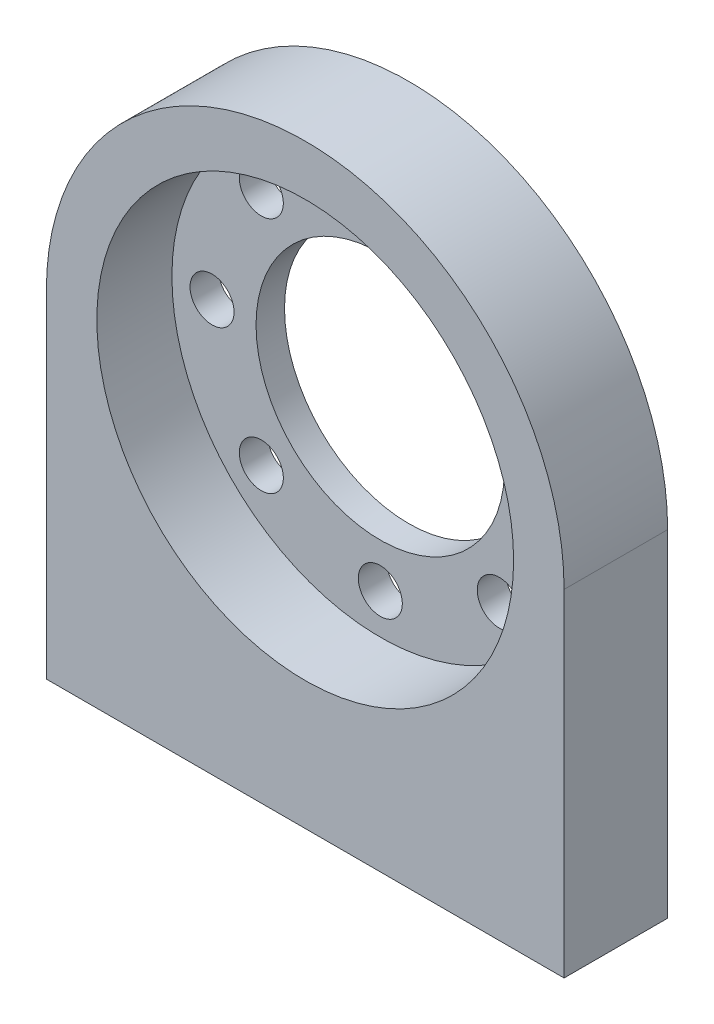
ISO-10303-21;
HEADER;
FILE_DESCRIPTION(('STEP AP214'),'2;1');
FILE_NAME('part.step','',(''),(''),'','','');
FILE_SCHEMA(('AUTOMOTIVE_DESIGN { 1 0 10303 214 1 1 1 1 }'));
ENDSEC;
DATA;
#1=APPLICATION_CONTEXT('core data for automotive mechanical design processes');
#2=APPLICATION_PROTOCOL_DEFINITION('international standard','automotive_design',2000,#1);
#3=PRODUCT_CONTEXT('',#1,'mechanical');
#4=PRODUCT('Part','Part','',(#3));
#5=PRODUCT_RELATED_PRODUCT_CATEGORY('part','',(#4));
#6=PRODUCT_DEFINITION_FORMATION('','',#4);
#7=PRODUCT_DEFINITION_CONTEXT('part definition',#1,'design');
#8=PRODUCT_DEFINITION('design','',#6,#7);
#9=PRODUCT_DEFINITION_SHAPE('','',#8);
#10=(LENGTH_UNIT() NAMED_UNIT(*) SI_UNIT(.MILLI.,.METRE.));
#11=(NAMED_UNIT(*) PLANE_ANGLE_UNIT() SI_UNIT($,.RADIAN.));
#12=(NAMED_UNIT(*) SI_UNIT($,.STERADIAN.) SOLID_ANGLE_UNIT());
#13=UNCERTAINTY_MEASURE_WITH_UNIT(LENGTH_MEASURE(1.E-05),#10,'distance_accuracy_value','');
#14=(GEOMETRIC_REPRESENTATION_CONTEXT(3) GLOBAL_UNCERTAINTY_ASSIGNED_CONTEXT((#13)) GLOBAL_UNIT_ASSIGNED_CONTEXT((#10,
#11,#12)) REPRESENTATION_CONTEXT('',''));
#15=CARTESIAN_POINT('',(0.,0.,0.));
#16=DIRECTION('',(0.,0.,1.));
#17=DIRECTION('',(1.,0.,0.));
#18=AXIS2_PLACEMENT_3D('',#15,#16,#17);
#19=CARTESIAN_POINT('',(0.,0.,8.));
#20=DIRECTION('',(0.,0.,-1.));
#21=DIRECTION('',(-1.,0.,0.));
#22=AXIS2_PLACEMENT_3D('',#19,#20,#21);
#23=PLANE('',#22);
#24=CARTESIAN_POINT('',(0.,0.,8.));
#25=DIRECTION('',(0.,0.,1.));
#26=DIRECTION('',(1.,0.,0.));
#27=AXIS2_PLACEMENT_3D('',#24,#25,#26);
#28=CIRCLE('',#27,16.1);
#29=CARTESIAN_POINT('',(16.1,0.,8.));
#30=VERTEX_POINT('',#29);
#31=EDGE_CURVE('E130',#30,#30,#28,.T.);
#32=ORIENTED_EDGE('',*,*,#31,.F.);
#33=EDGE_LOOP('',(#32));
#34=FACE_BOUND('',#33,.T.);
#35=CARTESIAN_POINT('',(0.,0.,8.));
#36=DIRECTION('',(0.,0.,1.));
#37=DIRECTION('',(-1.,0.,0.));
#38=AXIS2_PLACEMENT_3D('',#35,#36,#37);
#39=CIRCLE('',#38,20.);
#40=CARTESIAN_POINT('',(20.,0.,8.));
#41=VERTEX_POINT('',#40);
#42=CARTESIAN_POINT('',(-20.,0.,8.));
#43=VERTEX_POINT('',#42);
#44=EDGE_CURVE('E97',#41,#43,#39,.T.);
#45=ORIENTED_EDGE('',*,*,#44,.T.);
#46=DIRECTION('',(0.,-1.,0.));
#47=VECTOR('',#46,1.);
#48=CARTESIAN_POINT('',(-20.,0.,8.));
#49=LINE('',#48,#47);
#50=CARTESIAN_POINT('',(-20.,-26.,8.));
#51=VERTEX_POINT('',#50);
#52=EDGE_CURVE('E93',#43,#51,#49,.T.);
#53=ORIENTED_EDGE('',*,*,#52,.T.);
#54=DIRECTION('',(1.,0.,0.));
#55=VECTOR('',#54,1.);
#56=CARTESIAN_POINT('',(-20.,-26.,8.));
#57=LINE('',#56,#55);
#58=CARTESIAN_POINT('',(20.,-26.,8.));
#59=VERTEX_POINT('',#58);
#60=EDGE_CURVE('E95',#51,#59,#57,.T.);
#61=ORIENTED_EDGE('',*,*,#60,.T.);
#62=DIRECTION('',(0.,1.,0.));
#63=VECTOR('',#62,1.);
#64=CARTESIAN_POINT('',(20.,0.,8.));
#65=LINE('',#64,#63);
#66=EDGE_CURVE('E63',#59,#41,#65,.T.);
#67=ORIENTED_EDGE('',*,*,#66,.T.);
#68=EDGE_LOOP('',(#45,#53,#61,#67));
#69=FACE_BOUND('',#68,.T.);
#70=ADVANCED_FACE('F45',(#34,#69),#23,.F.);
#71=CARTESIAN_POINT('',(0.,0.,0.));
#72=DIRECTION('',(0.,0.,-1.));
#73=DIRECTION('',(-1.,0.,0.));
#74=AXIS2_PLACEMENT_3D('',#71,#72,#73);
#75=PLANE('',#74);
#76=CARTESIAN_POINT('',(0.,13.,0.));
#77=DIRECTION('',(0.,0.,-1.));
#78=DIRECTION('',(-1.,0.,0.));
#79=AXIS2_PLACEMENT_3D('',#76,#77,#78);
#80=CIRCLE('',#79,1.7);
#81=CARTESIAN_POINT('',(-1.7,13.,0.));
#82=VERTEX_POINT('',#81);
#83=EDGE_CURVE('E145',#82,#82,#80,.T.);
#84=ORIENTED_EDGE('',*,*,#83,.F.);
#85=EDGE_LOOP('',(#84));
#86=FACE_BOUND('',#85,.T.);
#87=CARTESIAN_POINT('',(9.19238815542512,9.19238815542511,0.));
#88=DIRECTION('',(0.,0.,-1.));
#89=DIRECTION('',(-1.,0.,0.));
#90=AXIS2_PLACEMENT_3D('',#87,#88,#89);
#91=CIRCLE('',#90,1.7);
#92=CARTESIAN_POINT('',(7.49238815542512,9.19238815542511,0.));
#93=VERTEX_POINT('',#92);
#94=EDGE_CURVE('E160',#93,#93,#91,.T.);
#95=ORIENTED_EDGE('',*,*,#94,.F.);
#96=EDGE_LOOP('',(#95));
#97=FACE_BOUND('',#96,.T.);
#98=CARTESIAN_POINT('',(9.19238815542512,-9.19238815542512,0.));
#99=DIRECTION('',(0.,0.,-1.));
#100=DIRECTION('',(-1.,0.,0.));
#101=AXIS2_PLACEMENT_3D('',#98,#99,#100);
#102=CIRCLE('',#101,1.7);
#103=CARTESIAN_POINT('',(7.49238815542512,-9.19238815542512,0.));
#104=VERTEX_POINT('',#103);
#105=EDGE_CURVE('E168',#104,#104,#102,.T.);
#106=ORIENTED_EDGE('',*,*,#105,.F.);
#107=EDGE_LOOP('',(#106));
#108=FACE_BOUND('',#107,.T.);
#109=CARTESIAN_POINT('',(0.,-13.,0.));
#110=DIRECTION('',(0.,0.,-1.));
#111=DIRECTION('',(-1.,0.,0.));
#112=AXIS2_PLACEMENT_3D('',#109,#110,#111);
#113=CIRCLE('',#112,1.7);
#114=CARTESIAN_POINT('',(-1.7,-13.,0.));
#115=VERTEX_POINT('',#114);
#116=EDGE_CURVE('E155',#115,#115,#113,.T.);
#117=ORIENTED_EDGE('',*,*,#116,.F.);
#118=EDGE_LOOP('',(#117));
#119=FACE_BOUND('',#118,.T.);
#120=CARTESIAN_POINT('',(13.,0.,0.));
#121=DIRECTION('',(0.,0.,-1.));
#122=DIRECTION('',(-1.,0.,0.));
#123=AXIS2_PLACEMENT_3D('',#120,#121,#122);
#124=CIRCLE('',#123,1.7);
#125=CARTESIAN_POINT('',(11.3,0.,0.));
#126=VERTEX_POINT('',#125);
#127=EDGE_CURVE('E142',#126,#126,#124,.T.);
#128=ORIENTED_EDGE('',*,*,#127,.F.);
#129=EDGE_LOOP('',(#128));
#130=FACE_BOUND('',#129,.T.);
#131=CARTESIAN_POINT('',(-9.19238815542511,9.19238815542512,0.));
#132=DIRECTION('',(0.,0.,-1.));
#133=DIRECTION('',(-1.,0.,0.));
#134=AXIS2_PLACEMENT_3D('',#131,#132,#133);
#135=CIRCLE('',#134,1.7);
#136=CARTESIAN_POINT('',(-10.8923881554251,9.19238815542512,0.));
#137=VERTEX_POINT('',#136);
#138=EDGE_CURVE('E134',#137,#137,#135,.T.);
#139=ORIENTED_EDGE('',*,*,#138,.F.);
#140=EDGE_LOOP('',(#139));
#141=FACE_BOUND('',#140,.T.);
#142=CARTESIAN_POINT('',(-13.,0.,0.));
#143=DIRECTION('',(0.,0.,-1.));
#144=DIRECTION('',(-1.,0.,0.));
#145=AXIS2_PLACEMENT_3D('',#142,#143,#144);
#146=CIRCLE('',#145,1.7);
#147=CARTESIAN_POINT('',(-14.7,0.,0.));
#148=VERTEX_POINT('',#147);
#149=EDGE_CURVE('E141',#148,#148,#146,.T.);
#150=ORIENTED_EDGE('',*,*,#149,.F.);
#151=EDGE_LOOP('',(#150));
#152=FACE_BOUND('',#151,.T.);
#153=CARTESIAN_POINT('',(-9.19238815542512,-9.19238815542512,0.));
#154=DIRECTION('',(0.,0.,-1.));
#155=DIRECTION('',(-1.,0.,0.));
#156=AXIS2_PLACEMENT_3D('',#153,#154,#155);
#157=CIRCLE('',#156,1.7);
#158=CARTESIAN_POINT('',(-10.8923881554251,-9.19238815542512,0.));
#159=VERTEX_POINT('',#158);
#160=EDGE_CURVE('E148',#159,#159,#157,.T.);
#161=ORIENTED_EDGE('',*,*,#160,.F.);
#162=EDGE_LOOP('',(#161));
#163=FACE_BOUND('',#162,.T.);
#164=CARTESIAN_POINT('',(0.,0.,0.));
#165=DIRECTION('',(0.,0.,1.));
#166=DIRECTION('',(-1.,0.,0.));
#167=AXIS2_PLACEMENT_3D('',#164,#165,#166);
#168=CIRCLE('',#167,20.);
#169=CARTESIAN_POINT('',(20.,0.,0.));
#170=VERTEX_POINT('',#169);
#171=CARTESIAN_POINT('',(-20.,0.,0.));
#172=VERTEX_POINT('',#171);
#173=EDGE_CURVE('E110',#170,#172,#168,.T.);
#174=ORIENTED_EDGE('',*,*,#173,.F.);
#175=DIRECTION('',(0.,1.,0.));
#176=VECTOR('',#175,1.);
#177=CARTESIAN_POINT('',(20.,0.,0.));
#178=LINE('',#177,#176);
#179=CARTESIAN_POINT('',(20.,-26.,0.));
#180=VERTEX_POINT('',#179);
#181=EDGE_CURVE('E86',#180,#170,#178,.T.);
#182=ORIENTED_EDGE('',*,*,#181,.F.);
#183=DIRECTION('',(1.,0.,0.));
#184=VECTOR('',#183,1.);
#185=CARTESIAN_POINT('',(-20.,-26.,0.));
#186=LINE('',#185,#184);
#187=CARTESIAN_POINT('',(-20.,-26.,0.));
#188=VERTEX_POINT('',#187);
#189=EDGE_CURVE('E80',#188,#180,#186,.T.);
#190=ORIENTED_EDGE('',*,*,#189,.F.);
#191=DIRECTION('',(0.,-1.,0.));
#192=VECTOR('',#191,1.);
#193=CARTESIAN_POINT('',(-20.,0.,0.));
#194=LINE('',#193,#192);
#195=EDGE_CURVE('E101',#172,#188,#194,.T.);
#196=ORIENTED_EDGE('',*,*,#195,.F.);
#197=EDGE_LOOP('',(#174,#182,#190,#196));
#198=FACE_BOUND('',#197,.T.);
#199=CARTESIAN_POINT('',(0.,0.,0.));
#200=DIRECTION('',(0.,0.,1.));
#201=DIRECTION('',(1.,0.,0.));
#202=AXIS2_PLACEMENT_3D('',#199,#200,#201);
#203=CIRCLE('',#202,9.6);
#204=CARTESIAN_POINT('',(9.6,0.,0.));
#205=VERTEX_POINT('',#204);
#206=EDGE_CURVE('E113',#205,#205,#203,.T.);
#207=ORIENTED_EDGE('',*,*,#206,.T.);
#208=EDGE_LOOP('',(#207));
#209=FACE_BOUND('',#208,.T.);
#210=ADVANCED_FACE('F121',(#86,#97,#108,#119,#130,#141,#152,#163,#198,#209),#75,.T.);
#211=CARTESIAN_POINT('',(0.,0.,8.));
#212=DIRECTION('',(0.,0.,-1.));
#213=DIRECTION('',(-1.,0.,0.));
#214=AXIS2_PLACEMENT_3D('',#211,#212,#213);
#215=CYLINDRICAL_SURFACE('',#214,20.);
#216=ORIENTED_EDGE('',*,*,#173,.T.);
#217=DIRECTION('',(0.,0.,-1.));
#218=VECTOR('',#217,1.);
#219=CARTESIAN_POINT('',(-20.,0.,8.));
#220=LINE('',#219,#218);
#221=EDGE_CURVE('E12',#43,#172,#220,.T.);
#222=ORIENTED_EDGE('',*,*,#221,.F.);
#223=ORIENTED_EDGE('',*,*,#44,.F.);
#224=DIRECTION('',(0.,0.,-1.));
#225=VECTOR('',#224,1.);
#226=CARTESIAN_POINT('',(20.,0.,8.));
#227=LINE('',#226,#225);
#228=EDGE_CURVE('E106',#41,#170,#227,.T.);
#229=ORIENTED_EDGE('',*,*,#228,.T.);
#230=EDGE_LOOP('',(#216,#222,#223,#229));
#231=FACE_BOUND('',#230,.T.);
#232=ADVANCED_FACE('F47',(#231),#215,.T.);
#233=CARTESIAN_POINT('',(-20.,0.,8.));
#234=DIRECTION('',(1.,0.,0.));
#235=DIRECTION('',(0.,1.,0.));
#236=AXIS2_PLACEMENT_3D('',#233,#234,#235);
#237=PLANE('',#236);
#238=ORIENTED_EDGE('',*,*,#195,.T.);
#239=DIRECTION('',(0.,0.,-1.));
#240=VECTOR('',#239,1.);
#241=CARTESIAN_POINT('',(-20.,-26.,8.));
#242=LINE('',#241,#240);
#243=EDGE_CURVE('E55',#51,#188,#242,.T.);
#244=ORIENTED_EDGE('',*,*,#243,.F.);
#245=ORIENTED_EDGE('',*,*,#52,.F.);
#246=ORIENTED_EDGE('',*,*,#221,.T.);
#247=EDGE_LOOP('',(#238,#244,#245,#246));
#248=FACE_BOUND('',#247,.T.);
#249=ADVANCED_FACE('F100',(#248),#237,.F.);
#250=CARTESIAN_POINT('',(-20.,-26.,8.));
#251=DIRECTION('',(0.,1.,0.));
#252=DIRECTION('',(0.,0.,1.));
#253=AXIS2_PLACEMENT_3D('',#250,#251,#252);
#254=PLANE('',#253);
#255=CARTESIAN_POINT('',(-16.,-26.,4.));
#256=DIRECTION('',(0.,-1.,0.));
#257=DIRECTION('',(0.,0.,-1.));
#258=AXIS2_PLACEMENT_3D('',#255,#256,#257);
#259=CIRCLE('',#258,1.25);
#260=CARTESIAN_POINT('',(-16.,-26.,2.75));
#261=VERTEX_POINT('',#260);
#262=EDGE_CURVE('E188',#261,#261,#259,.T.);
#263=ORIENTED_EDGE('',*,*,#262,.F.);
#264=EDGE_LOOP('',(#263));
#265=FACE_BOUND('',#264,.T.);
#266=CARTESIAN_POINT('',(16.,-26.,4.));
#267=DIRECTION('',(0.,-1.,0.));
#268=DIRECTION('',(0.,0.,-1.));
#269=AXIS2_PLACEMENT_3D('',#266,#267,#268);
#270=CIRCLE('',#269,1.25);
#271=CARTESIAN_POINT('',(16.,-26.,2.75));
#272=VERTEX_POINT('',#271);
#273=EDGE_CURVE('E185',#272,#272,#270,.T.);
#274=ORIENTED_EDGE('',*,*,#273,.F.);
#275=EDGE_LOOP('',(#274));
#276=FACE_BOUND('',#275,.T.);
#277=ORIENTED_EDGE('',*,*,#189,.T.);
#278=DIRECTION('',(0.,0.,-1.));
#279=VECTOR('',#278,1.);
#280=CARTESIAN_POINT('',(20.,-26.,8.));
#281=LINE('',#280,#279);
#282=EDGE_CURVE('E102',#59,#180,#281,.T.);
#283=ORIENTED_EDGE('',*,*,#282,.F.);
#284=ORIENTED_EDGE('',*,*,#60,.F.);
#285=ORIENTED_EDGE('',*,*,#243,.T.);
#286=EDGE_LOOP('',(#277,#283,#284,#285));
#287=FACE_BOUND('',#286,.T.);
#288=ADVANCED_FACE('F104',(#265,#276,#287),#254,.F.);
#289=CARTESIAN_POINT('',(20.,0.,8.));
#290=DIRECTION('',(-1.,0.,0.));
#291=DIRECTION('',(0.,-1.,0.));
#292=AXIS2_PLACEMENT_3D('',#289,#290,#291);
#293=PLANE('',#292);
#294=ORIENTED_EDGE('',*,*,#181,.T.);
#295=ORIENTED_EDGE('',*,*,#228,.F.);
#296=ORIENTED_EDGE('',*,*,#66,.F.);
#297=ORIENTED_EDGE('',*,*,#282,.T.);
#298=EDGE_LOOP('',(#294,#295,#296,#297));
#299=FACE_BOUND('',#298,.T.);
#300=ADVANCED_FACE('F118',(#299),#293,.F.);
#301=CARTESIAN_POINT('',(0.,0.,8.));
#302=DIRECTION('',(0.,0.,-1.));
#303=DIRECTION('',(-1.,0.,0.));
#304=AXIS2_PLACEMENT_3D('',#301,#302,#303);
#305=CYLINDRICAL_SURFACE('',#304,9.6);
#306=CARTESIAN_POINT('',(0.,0.,2.2));
#307=DIRECTION('',(0.,0.,-1.));
#308=DIRECTION('',(-1.,0.,0.));
#309=AXIS2_PLACEMENT_3D('',#306,#307,#308);
#310=CIRCLE('',#309,9.6);
#311=CARTESIAN_POINT('',(-9.6,0.,2.2));
#312=VERTEX_POINT('',#311);
#313=EDGE_CURVE('E49',#312,#312,#310,.T.);
#314=ORIENTED_EDGE('',*,*,#313,.F.);
#315=EDGE_LOOP('',(#314));
#316=FACE_BOUND('',#315,.T.);
#317=ORIENTED_EDGE('',*,*,#206,.F.);
#318=EDGE_LOOP('',(#317));
#319=FACE_BOUND('',#318,.T.);
#320=ADVANCED_FACE('F235',(#316,#319),#305,.F.);
#321=CARTESIAN_POINT('',(0.,0.,2.2));
#322=DIRECTION('',(0.,0.,-1.));
#323=DIRECTION('',(-1.,0.,0.));
#324=AXIS2_PLACEMENT_3D('',#321,#322,#323);
#325=PLANE('',#324);
#326=CARTESIAN_POINT('',(0.,13.,2.2));
#327=DIRECTION('',(0.,0.,-1.));
#328=DIRECTION('',(-1.,0.,0.));
#329=AXIS2_PLACEMENT_3D('',#326,#327,#328);
#330=CIRCLE('',#329,1.7);
#331=CARTESIAN_POINT('',(-1.7,13.,2.2));
#332=VERTEX_POINT('',#331);
#333=EDGE_CURVE('E133',#332,#332,#330,.F.);
#334=ORIENTED_EDGE('',*,*,#333,.F.);
#335=EDGE_LOOP('',(#334));
#336=FACE_BOUND('',#335,.T.);
#337=CARTESIAN_POINT('',(9.19238815542512,9.19238815542511,2.2));
#338=DIRECTION('',(0.,0.,-1.));
#339=DIRECTION('',(-1.,0.,0.));
#340=AXIS2_PLACEMENT_3D('',#337,#338,#339);
#341=CIRCLE('',#340,1.7);
#342=CARTESIAN_POINT('',(7.49238815542512,9.19238815542511,2.2));
#343=VERTEX_POINT('',#342);
#344=EDGE_CURVE('E164',#343,#343,#341,.F.);
#345=ORIENTED_EDGE('',*,*,#344,.F.);
#346=EDGE_LOOP('',(#345));
#347=FACE_BOUND('',#346,.T.);
#348=CARTESIAN_POINT('',(9.19238815542512,-9.19238815542512,2.2));
#349=DIRECTION('',(0.,0.,-1.));
#350=DIRECTION('',(-1.,0.,0.));
#351=AXIS2_PLACEMENT_3D('',#348,#349,#350);
#352=CIRCLE('',#351,1.7);
#353=CARTESIAN_POINT('',(7.49238815542512,-9.19238815542512,2.2));
#354=VERTEX_POINT('',#353);
#355=EDGE_CURVE('E163',#354,#354,#352,.F.);
#356=ORIENTED_EDGE('',*,*,#355,.F.);
#357=EDGE_LOOP('',(#356));
#358=FACE_BOUND('',#357,.T.);
#359=CARTESIAN_POINT('',(0.,-13.,2.2));
#360=DIRECTION('',(0.,0.,-1.));
#361=DIRECTION('',(-1.,0.,0.));
#362=AXIS2_PLACEMENT_3D('',#359,#360,#361);
#363=CIRCLE('',#362,1.7);
#364=CARTESIAN_POINT('',(-1.7,-13.,2.2));
#365=VERTEX_POINT('',#364);
#366=EDGE_CURVE('E171',#365,#365,#363,.F.);
#367=ORIENTED_EDGE('',*,*,#366,.F.);
#368=EDGE_LOOP('',(#367));
#369=FACE_BOUND('',#368,.T.);
#370=CARTESIAN_POINT('',(13.,0.,2.2));
#371=DIRECTION('',(0.,0.,-1.));
#372=DIRECTION('',(-1.,0.,0.));
#373=AXIS2_PLACEMENT_3D('',#370,#371,#372);
#374=CIRCLE('',#373,1.7);
#375=CARTESIAN_POINT('',(11.3,0.,2.2));
#376=VERTEX_POINT('',#375);
#377=EDGE_CURVE('E137',#376,#376,#374,.F.);
#378=ORIENTED_EDGE('',*,*,#377,.F.);
#379=EDGE_LOOP('',(#378));
#380=FACE_BOUND('',#379,.T.);
#381=CARTESIAN_POINT('',(-9.19238815542511,9.19238815542512,2.2));
#382=DIRECTION('',(0.,0.,-1.));
#383=DIRECTION('',(-1.,0.,0.));
#384=AXIS2_PLACEMENT_3D('',#381,#382,#383);
#385=CIRCLE('',#384,1.7);
#386=CARTESIAN_POINT('',(-10.8923881554251,9.19238815542512,2.2));
#387=VERTEX_POINT('',#386);
#388=EDGE_CURVE('E138',#387,#387,#385,.F.);
#389=ORIENTED_EDGE('',*,*,#388,.F.);
#390=EDGE_LOOP('',(#389));
#391=FACE_BOUND('',#390,.T.);
#392=CARTESIAN_POINT('',(-13.,0.,2.2));
#393=DIRECTION('',(0.,0.,-1.));
#394=DIRECTION('',(-1.,0.,0.));
#395=AXIS2_PLACEMENT_3D('',#392,#393,#394);
#396=CIRCLE('',#395,1.7);
#397=CARTESIAN_POINT('',(-14.7,0.,2.2));
#398=VERTEX_POINT('',#397);
#399=EDGE_CURVE('E151',#398,#398,#396,.F.);
#400=ORIENTED_EDGE('',*,*,#399,.F.);
#401=EDGE_LOOP('',(#400));
#402=FACE_BOUND('',#401,.T.);
#403=CARTESIAN_POINT('',(-9.19238815542512,-9.19238815542512,2.2));
#404=DIRECTION('',(0.,0.,-1.));
#405=DIRECTION('',(-1.,0.,0.));
#406=AXIS2_PLACEMENT_3D('',#403,#404,#405);
#407=CIRCLE('',#406,1.7);
#408=CARTESIAN_POINT('',(-10.8923881554251,-9.19238815542512,2.2));
#409=VERTEX_POINT('',#408);
#410=EDGE_CURVE('E152',#409,#409,#407,.F.);
#411=ORIENTED_EDGE('',*,*,#410,.F.);
#412=EDGE_LOOP('',(#411));
#413=FACE_BOUND('',#412,.T.);
#414=ORIENTED_EDGE('',*,*,#313,.T.);
#415=EDGE_LOOP('',(#414));
#416=FACE_BOUND('',#415,.T.);
#417=CARTESIAN_POINT('',(0.,0.,2.2));
#418=DIRECTION('',(0.,0.,-1.));
#419=DIRECTION('',(-1.,0.,0.));
#420=AXIS2_PLACEMENT_3D('',#417,#418,#419);
#421=CIRCLE('',#420,16.1);
#422=CARTESIAN_POINT('',(-16.1,0.,2.2));
#423=VERTEX_POINT('',#422);
#424=EDGE_CURVE('E127',#423,#423,#421,.F.);
#425=ORIENTED_EDGE('',*,*,#424,.T.);
#426=EDGE_LOOP('',(#425));
#427=FACE_BOUND('',#426,.T.);
#428=ADVANCED_FACE('F273',(#336,#347,#358,#369,#380,#391,#402,#413,#416,#427),#325,.F.);
#429=CARTESIAN_POINT('',(0.,0.,-45.5376767084137));
#430=DIRECTION('',(0.,0.,1.));
#431=DIRECTION('',(1.,0.,0.));
#432=AXIS2_PLACEMENT_3D('',#429,#430,#431);
#433=CYLINDRICAL_SURFACE('',#432,16.1);
#434=ORIENTED_EDGE('',*,*,#31,.T.);
#435=EDGE_LOOP('',(#434));
#436=FACE_BOUND('',#435,.T.);
#437=ORIENTED_EDGE('',*,*,#424,.F.);
#438=EDGE_LOOP('',(#437));
#439=FACE_BOUND('',#438,.T.);
#440=ADVANCED_FACE('F283',(#436,#439),#433,.F.);
#441=CARTESIAN_POINT('',(-9.19238815542512,-9.19238815542512,8.001));
#442=DIRECTION('',(0.,0.,-1.));
#443=DIRECTION('',(-1.,0.,0.));
#444=AXIS2_PLACEMENT_3D('',#441,#442,#443);
#445=CYLINDRICAL_SURFACE('',#444,1.7);
#446=ORIENTED_EDGE('',*,*,#160,.T.);
#447=EDGE_LOOP('',(#446));
#448=FACE_BOUND('',#447,.T.);
#449=ORIENTED_EDGE('',*,*,#410,.T.);
#450=EDGE_LOOP('',(#449));
#451=FACE_BOUND('',#450,.T.);
#452=ADVANCED_FACE('F292',(#448,#451),#445,.F.);
#453=CARTESIAN_POINT('',(-13.,0.,8.001));
#454=DIRECTION('',(0.,0.,-1.));
#455=DIRECTION('',(-1.,0.,0.));
#456=AXIS2_PLACEMENT_3D('',#453,#454,#455);
#457=CYLINDRICAL_SURFACE('',#456,1.7);
#458=ORIENTED_EDGE('',*,*,#149,.T.);
#459=EDGE_LOOP('',(#458));
#460=FACE_BOUND('',#459,.T.);
#461=ORIENTED_EDGE('',*,*,#399,.T.);
#462=EDGE_LOOP('',(#461));
#463=FACE_BOUND('',#462,.T.);
#464=ADVANCED_FACE('F301',(#460,#463),#457,.F.);
#465=CARTESIAN_POINT('',(-9.19238815542511,9.19238815542512,8.001));
#466=DIRECTION('',(0.,0.,-1.));
#467=DIRECTION('',(-1.,0.,0.));
#468=AXIS2_PLACEMENT_3D('',#465,#466,#467);
#469=CYLINDRICAL_SURFACE('',#468,1.7);
#470=ORIENTED_EDGE('',*,*,#138,.T.);
#471=EDGE_LOOP('',(#470));
#472=FACE_BOUND('',#471,.T.);
#473=ORIENTED_EDGE('',*,*,#388,.T.);
#474=EDGE_LOOP('',(#473));
#475=FACE_BOUND('',#474,.T.);
#476=ADVANCED_FACE('F311',(#472,#475),#469,.F.);
#477=CARTESIAN_POINT('',(13.,0.,8.001));
#478=DIRECTION('',(0.,0.,-1.));
#479=DIRECTION('',(-1.,0.,0.));
#480=AXIS2_PLACEMENT_3D('',#477,#478,#479);
#481=CYLINDRICAL_SURFACE('',#480,1.7);
#482=ORIENTED_EDGE('',*,*,#127,.T.);
#483=EDGE_LOOP('',(#482));
#484=FACE_BOUND('',#483,.T.);
#485=ORIENTED_EDGE('',*,*,#377,.T.);
#486=EDGE_LOOP('',(#485));
#487=FACE_BOUND('',#486,.T.);
#488=ADVANCED_FACE('F321',(#484,#487),#481,.F.);
#489=CARTESIAN_POINT('',(0.,-13.,8.001));
#490=DIRECTION('',(0.,0.,-1.));
#491=DIRECTION('',(-1.,0.,0.));
#492=AXIS2_PLACEMENT_3D('',#489,#490,#491);
#493=CYLINDRICAL_SURFACE('',#492,1.7);
#494=ORIENTED_EDGE('',*,*,#116,.T.);
#495=EDGE_LOOP('',(#494));
#496=FACE_BOUND('',#495,.T.);
#497=ORIENTED_EDGE('',*,*,#366,.T.);
#498=EDGE_LOOP('',(#497));
#499=FACE_BOUND('',#498,.T.);
#500=ADVANCED_FACE('F331',(#496,#499),#493,.F.);
#501=CARTESIAN_POINT('',(9.19238815542512,-9.19238815542512,8.001));
#502=DIRECTION('',(0.,0.,-1.));
#503=DIRECTION('',(-1.,0.,0.));
#504=AXIS2_PLACEMENT_3D('',#501,#502,#503);
#505=CYLINDRICAL_SURFACE('',#504,1.7);
#506=ORIENTED_EDGE('',*,*,#105,.T.);
#507=EDGE_LOOP('',(#506));
#508=FACE_BOUND('',#507,.T.);
#509=ORIENTED_EDGE('',*,*,#355,.T.);
#510=EDGE_LOOP('',(#509));
#511=FACE_BOUND('',#510,.T.);
#512=ADVANCED_FACE('F341',(#508,#511),#505,.F.);
#513=CARTESIAN_POINT('',(9.19238815542512,9.19238815542511,8.001));
#514=DIRECTION('',(0.,0.,-1.));
#515=DIRECTION('',(-1.,0.,0.));
#516=AXIS2_PLACEMENT_3D('',#513,#514,#515);
#517=CYLINDRICAL_SURFACE('',#516,1.7);
#518=ORIENTED_EDGE('',*,*,#94,.T.);
#519=EDGE_LOOP('',(#518));
#520=FACE_BOUND('',#519,.T.);
#521=ORIENTED_EDGE('',*,*,#344,.T.);
#522=EDGE_LOOP('',(#521));
#523=FACE_BOUND('',#522,.T.);
#524=ADVANCED_FACE('F219',(#520,#523),#517,.F.);
#525=CARTESIAN_POINT('',(0.,13.,8.001));
#526=DIRECTION('',(0.,0.,-1.));
#527=DIRECTION('',(-1.,0.,0.));
#528=AXIS2_PLACEMENT_3D('',#525,#526,#527);
#529=CYLINDRICAL_SURFACE('',#528,1.7);
#530=ORIENTED_EDGE('',*,*,#83,.T.);
#531=EDGE_LOOP('',(#530));
#532=FACE_BOUND('',#531,.T.);
#533=ORIENTED_EDGE('',*,*,#333,.T.);
#534=EDGE_LOOP('',(#533));
#535=FACE_BOUND('',#534,.T.);
#536=ADVANCED_FACE('F210',(#532,#535),#529,.F.);
#537=CARTESIAN_POINT('',(16.,-11.,4.));
#538=DIRECTION('',(0.,-1.,0.));
#539=DIRECTION('',(0.,0.,-1.));
#540=AXIS2_PLACEMENT_3D('',#537,#538,#539);
#541=CYLINDRICAL_SURFACE('',#540,1.25);
#542=CARTESIAN_POINT('',(16.,-11.,4.));
#543=DIRECTION('',(0.,-1.,0.));
#544=DIRECTION('',(0.,0.,-1.));
#545=AXIS2_PLACEMENT_3D('',#542,#543,#544);
#546=CIRCLE('',#545,1.25);
#547=CARTESIAN_POINT('',(16.,-11.,2.75));
#548=VERTEX_POINT('',#547);
#549=EDGE_CURVE('E182',#548,#548,#546,.T.);
#550=ORIENTED_EDGE('',*,*,#549,.F.);
#551=EDGE_LOOP('',(#550));
#552=FACE_BOUND('',#551,.T.);
#553=ORIENTED_EDGE('',*,*,#273,.T.);
#554=EDGE_LOOP('',(#553));
#555=FACE_BOUND('',#554,.T.);
#556=ADVANCED_FACE('F208',(#552,#555),#541,.F.);
#557=CARTESIAN_POINT('',(16.,-11.,4.));
#558=DIRECTION('',(0.,-1.,0.));
#559=DIRECTION('',(0.,0.,-1.));
#560=AXIS2_PLACEMENT_3D('',#557,#558,#559);
#561=PLANE('',#560);
#562=ORIENTED_EDGE('',*,*,#549,.T.);
#563=EDGE_LOOP('',(#562));
#564=FACE_BOUND('',#563,.T.);
#565=ADVANCED_FACE('F199',(#564),#561,.T.);
#566=CARTESIAN_POINT('',(-16.,-11.,4.));
#567=DIRECTION('',(0.,-1.,0.));
#568=DIRECTION('',(0.,0.,-1.));
#569=AXIS2_PLACEMENT_3D('',#566,#567,#568);
#570=CYLINDRICAL_SURFACE('',#569,1.25);
#571=CARTESIAN_POINT('',(-16.,-11.,4.));
#572=DIRECTION('',(0.,-1.,0.));
#573=DIRECTION('',(0.,0.,-1.));
#574=AXIS2_PLACEMENT_3D('',#571,#572,#573);
#575=CIRCLE('',#574,1.25);
#576=CARTESIAN_POINT('',(-16.,-11.,2.75));
#577=VERTEX_POINT('',#576);
#578=EDGE_CURVE('E167',#577,#577,#575,.T.);
#579=ORIENTED_EDGE('',*,*,#578,.F.);
#580=EDGE_LOOP('',(#579));
#581=FACE_BOUND('',#580,.T.);
#582=ORIENTED_EDGE('',*,*,#262,.T.);
#583=EDGE_LOOP('',(#582));
#584=FACE_BOUND('',#583,.T.);
#585=ADVANCED_FACE('F196',(#581,#584),#570,.F.);
#586=CARTESIAN_POINT('',(-16.,-11.,4.));
#587=DIRECTION('',(0.,-1.,0.));
#588=DIRECTION('',(0.,0.,-1.));
#589=AXIS2_PLACEMENT_3D('',#586,#587,#588);
#590=PLANE('',#589);
#591=ORIENTED_EDGE('',*,*,#578,.T.);
#592=EDGE_LOOP('',(#591));
#593=FACE_BOUND('',#592,.T.);
#594=ADVANCED_FACE('F194',(#593),#590,.T.);
#595=CLOSED_SHELL('',(#70,#210,#232,#249,#288,#300,#320,#428,#440,#452,#464,#476,#488,#500,#512,
#524,#536,#556,#565,#585,#594));
#596=MANIFOLD_SOLID_BREP('B2',#595);
#597=ADVANCED_BREP_SHAPE_REPRESENTATION('',(#18,#596),#14);
#598=SHAPE_DEFINITION_REPRESENTATION(#9,#597);
ENDSEC;
END-ISO-10303-21;
